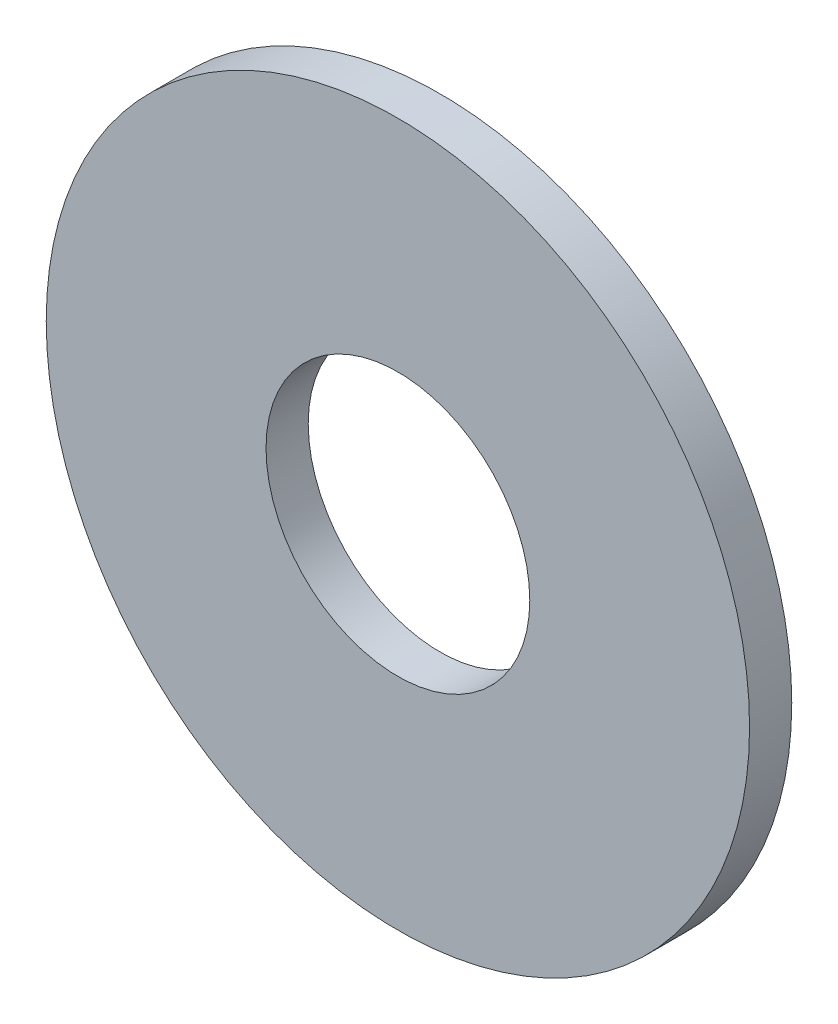
ISO-10303-21;
HEADER;
FILE_DESCRIPTION(('STEP AP214'),'2;1');
FILE_NAME('part.step','',(''),(''),'','','');
FILE_SCHEMA(('AUTOMOTIVE_DESIGN { 1 0 10303 214 1 1 1 1 }'));
ENDSEC;
DATA;
#1=APPLICATION_CONTEXT('core data for automotive mechanical design processes');
#2=APPLICATION_PROTOCOL_DEFINITION('international standard','automotive_design',2000,#1);
#3=PRODUCT_CONTEXT('',#1,'mechanical');
#4=PRODUCT('Part','Part','',(#3));
#5=PRODUCT_RELATED_PRODUCT_CATEGORY('part','',(#4));
#6=PRODUCT_DEFINITION_FORMATION('','',#4);
#7=PRODUCT_DEFINITION_CONTEXT('part definition',#1,'design');
#8=PRODUCT_DEFINITION('design','',#6,#7);
#9=PRODUCT_DEFINITION_SHAPE('','',#8);
#10=(LENGTH_UNIT() NAMED_UNIT(*) SI_UNIT(.MILLI.,.METRE.));
#11=(NAMED_UNIT(*) PLANE_ANGLE_UNIT() SI_UNIT($,.RADIAN.));
#12=(NAMED_UNIT(*) SI_UNIT($,.STERADIAN.) SOLID_ANGLE_UNIT());
#13=UNCERTAINTY_MEASURE_WITH_UNIT(LENGTH_MEASURE(1.E-05),#10,'distance_accuracy_value','');
#14=(GEOMETRIC_REPRESENTATION_CONTEXT(3) GLOBAL_UNCERTAINTY_ASSIGNED_CONTEXT((#13)) GLOBAL_UNIT_ASSIGNED_CONTEXT((#10,
#11,#12)) REPRESENTATION_CONTEXT('',''));
#15=CARTESIAN_POINT('',(0.,0.,0.));
#16=DIRECTION('',(0.,0.,1.));
#17=DIRECTION('',(1.,0.,0.));
#18=AXIS2_PLACEMENT_3D('',#15,#16,#17);
#19=CARTESIAN_POINT('',(0.,0.,-0.762));
#20=DIRECTION('',(0.,0.,1.));
#21=DIRECTION('',(1.,0.,0.));
#22=AXIS2_PLACEMENT_3D('',#19,#20,#21);
#23=CYLINDRICAL_SURFACE('',#22,6.35);
#24=CARTESIAN_POINT('',(0.,0.,-0.762));
#25=DIRECTION('',(0.,0.,1.));
#26=DIRECTION('',(1.,0.,0.));
#27=AXIS2_PLACEMENT_3D('',#24,#25,#26);
#28=CIRCLE('',#27,6.35);
#29=CARTESIAN_POINT('',(6.35,0.,-0.762));
#30=VERTEX_POINT('',#29);
#31=EDGE_CURVE('E10',#30,#30,#28,.T.);
#32=ORIENTED_EDGE('',*,*,#31,.T.);
#33=EDGE_LOOP('',(#32));
#34=FACE_BOUND('',#33,.T.);
#35=CARTESIAN_POINT('',(0.,0.,0.));
#36=DIRECTION('',(0.,0.,1.));
#37=DIRECTION('',(1.,0.,0.));
#38=AXIS2_PLACEMENT_3D('',#35,#36,#37);
#39=CIRCLE('',#38,6.35);
#40=CARTESIAN_POINT('',(6.35,0.,0.));
#41=VERTEX_POINT('',#40);
#42=EDGE_CURVE('E33',#41,#41,#39,.T.);
#43=ORIENTED_EDGE('',*,*,#42,.F.);
#44=EDGE_LOOP('',(#43));
#45=FACE_BOUND('',#44,.T.);
#46=ADVANCED_FACE('F30',(#34,#45),#23,.T.);
#47=CARTESIAN_POINT('',(0.,0.,-0.762));
#48=DIRECTION('',(0.,0.,1.));
#49=DIRECTION('',(1.,0.,0.));
#50=AXIS2_PLACEMENT_3D('',#47,#48,#49);
#51=PLANE('',#50);
#52=CARTESIAN_POINT('',(0.,0.,-0.762));
#53=DIRECTION('',(0.,0.,1.));
#54=DIRECTION('',(1.,0.,0.));
#55=AXIS2_PLACEMENT_3D('',#52,#53,#54);
#56=CIRCLE('',#55,2.38125);
#57=CARTESIAN_POINT('',(2.38125,0.,-0.762));
#58=VERTEX_POINT('',#57);
#59=EDGE_CURVE('E40',#58,#58,#56,.T.);
#60=ORIENTED_EDGE('',*,*,#59,.T.);
#61=EDGE_LOOP('',(#60));
#62=FACE_BOUND('',#61,.T.);
#63=ORIENTED_EDGE('',*,*,#31,.F.);
#64=EDGE_LOOP('',(#63));
#65=FACE_BOUND('',#64,.T.);
#66=ADVANCED_FACE('F48',(#62,#65),#51,.F.);
#67=CARTESIAN_POINT('',(0.,0.,0.));
#68=DIRECTION('',(0.,0.,1.));
#69=DIRECTION('',(1.,0.,0.));
#70=AXIS2_PLACEMENT_3D('',#67,#68,#69);
#71=PLANE('',#70);
#72=CARTESIAN_POINT('',(0.,0.,0.));
#73=DIRECTION('',(0.,0.,1.));
#74=DIRECTION('',(1.,0.,0.));
#75=AXIS2_PLACEMENT_3D('',#72,#73,#74);
#76=CIRCLE('',#75,2.38125);
#77=CARTESIAN_POINT('',(2.38125,0.,0.));
#78=VERTEX_POINT('',#77);
#79=EDGE_CURVE('E42',#78,#78,#76,.T.);
#80=ORIENTED_EDGE('',*,*,#79,.F.);
#81=EDGE_LOOP('',(#80));
#82=FACE_BOUND('',#81,.T.);
#83=ORIENTED_EDGE('',*,*,#42,.T.);
#84=EDGE_LOOP('',(#83));
#85=FACE_BOUND('',#84,.T.);
#86=ADVANCED_FACE('F54',(#82,#85),#71,.T.);
#87=CARTESIAN_POINT('',(0.,0.,-0.762));
#88=DIRECTION('',(0.,0.,1.));
#89=DIRECTION('',(1.,0.,0.));
#90=AXIS2_PLACEMENT_3D('',#87,#88,#89);
#91=CYLINDRICAL_SURFACE('',#90,2.38125);
#92=ORIENTED_EDGE('',*,*,#59,.F.);
#93=EDGE_LOOP('',(#92));
#94=FACE_BOUND('',#93,.T.);
#95=ORIENTED_EDGE('',*,*,#79,.T.);
#96=EDGE_LOOP('',(#95));
#97=FACE_BOUND('',#96,.T.);
#98=ADVANCED_FACE('F51',(#94,#97),#91,.F.);
#99=CLOSED_SHELL('',(#46,#66,#86,#98));
#100=MANIFOLD_SOLID_BREP('B2',#99);
#101=ADVANCED_BREP_SHAPE_REPRESENTATION('',(#18,#100),#14);
#102=SHAPE_DEFINITION_REPRESENTATION(#9,#101);
ENDSEC;
END-ISO-10303-21;
